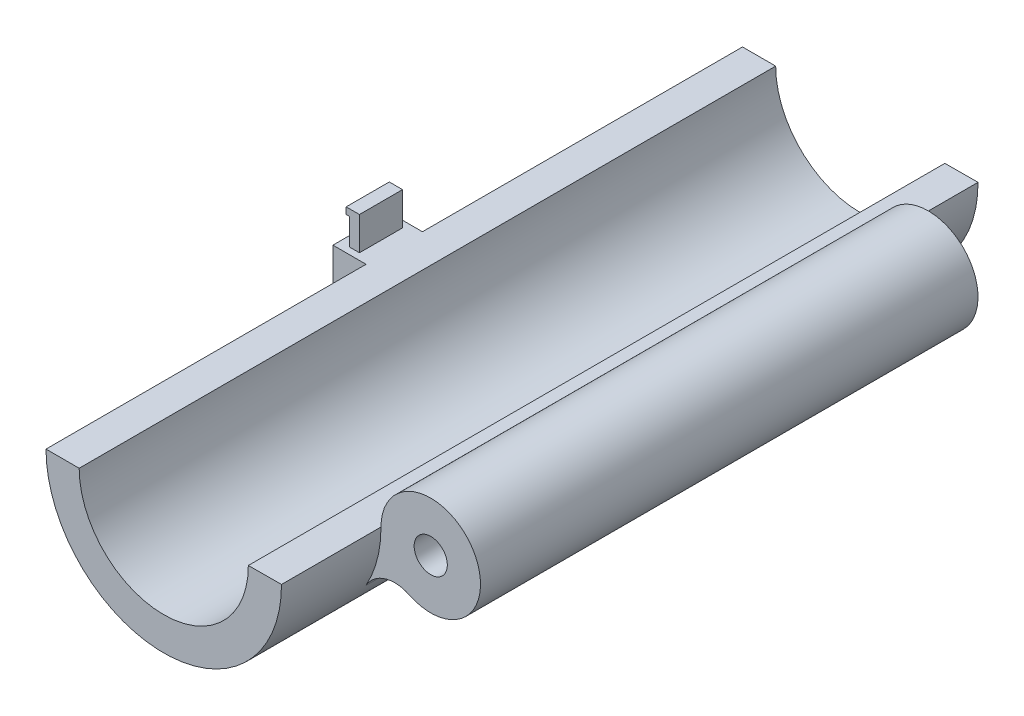
ISO-10303-21;
HEADER;
FILE_DESCRIPTION(('STEP AP214'),'2;1');
FILE_NAME('part.step','',(''),(''),'','','');
FILE_SCHEMA(('AUTOMOTIVE_DESIGN { 1 0 10303 214 1 1 1 1 }'));
ENDSEC;
DATA;
#1=APPLICATION_CONTEXT('core data for automotive mechanical design processes');
#2=APPLICATION_PROTOCOL_DEFINITION('international standard','automotive_design',2000,#1);
#3=PRODUCT_CONTEXT('',#1,'mechanical');
#4=PRODUCT('Part','Part','',(#3));
#5=PRODUCT_RELATED_PRODUCT_CATEGORY('part','',(#4));
#6=PRODUCT_DEFINITION_FORMATION('','',#4);
#7=PRODUCT_DEFINITION_CONTEXT('part definition',#1,'design');
#8=PRODUCT_DEFINITION('design','',#6,#7);
#9=PRODUCT_DEFINITION_SHAPE('','',#8);
#10=(LENGTH_UNIT() NAMED_UNIT(*) SI_UNIT(.MILLI.,.METRE.));
#11=(NAMED_UNIT(*) PLANE_ANGLE_UNIT() SI_UNIT($,.RADIAN.));
#12=(NAMED_UNIT(*) SI_UNIT($,.STERADIAN.) SOLID_ANGLE_UNIT());
#13=UNCERTAINTY_MEASURE_WITH_UNIT(LENGTH_MEASURE(1.E-05),#10,'distance_accuracy_value','');
#14=(GEOMETRIC_REPRESENTATION_CONTEXT(3) GLOBAL_UNCERTAINTY_ASSIGNED_CONTEXT((#13)) GLOBAL_UNIT_ASSIGNED_CONTEXT((#10,
#11,#12)) REPRESENTATION_CONTEXT('',''));
#15=CARTESIAN_POINT('',(0.,0.,0.));
#16=DIRECTION('',(0.,0.,1.));
#17=DIRECTION('',(1.,0.,0.));
#18=AXIS2_PLACEMENT_3D('',#15,#16,#17);
#19=CARTESIAN_POINT('',(-10.795,2.54,25.019));
#20=DIRECTION('',(1.,0.,0.));
#21=DIRECTION('',(0.,1.,0.));
#22=AXIS2_PLACEMENT_3D('',#19,#20,#21);
#23=PLANE('',#22);
#24=DIRECTION('',(0.,0.,1.));
#25=VECTOR('',#24,1.);
#26=CARTESIAN_POINT('',(-10.795,2.032,25.019));
#27=LINE('',#26,#25);
#28=CARTESIAN_POINT('',(-10.795,2.032,25.019));
#29=VERTEX_POINT('',#28);
#30=CARTESIAN_POINT('',(-10.795,2.032,28.321));
#31=VERTEX_POINT('',#30);
#32=EDGE_CURVE('E170',#29,#31,#27,.T.);
#33=ORIENTED_EDGE('',*,*,#32,.F.);
#34=DIRECTION('',(0.,-1.,0.));
#35=VECTOR('',#34,1.);
#36=CARTESIAN_POINT('',(-10.795,2.54,25.019));
#37=LINE('',#36,#35);
#38=CARTESIAN_POINT('',(-10.795,0.,25.019));
#39=VERTEX_POINT('',#38);
#40=EDGE_CURVE('E197',#29,#39,#37,.T.);
#41=ORIENTED_EDGE('',*,*,#40,.T.);
#42=DIRECTION('',(0.,0.,1.));
#43=VECTOR('',#42,1.);
#44=CARTESIAN_POINT('',(-10.795,0.,25.019));
#45=LINE('',#44,#43);
#46=CARTESIAN_POINT('',(-10.795,0.,28.321));
#47=VERTEX_POINT('',#46);
#48=EDGE_CURVE('E178',#39,#47,#45,.T.);
#49=ORIENTED_EDGE('',*,*,#48,.T.);
#50=DIRECTION('',(0.,-1.,0.));
#51=VECTOR('',#50,1.);
#52=CARTESIAN_POINT('',(-10.795,2.54,28.321));
#53=LINE('',#52,#51);
#54=EDGE_CURVE('E210',#31,#47,#53,.T.);
#55=ORIENTED_EDGE('',*,*,#54,.F.);
#56=EDGE_LOOP('',(#33,#41,#49,#55));
#57=FACE_BOUND('',#56,.T.);
#58=ADVANCED_FACE('F33',(#57),#23,.F.);
#59=CARTESIAN_POINT('',(-9.017,0.,53.34));
#60=DIRECTION('',(0.,1.,0.));
#61=DIRECTION('',(-1.,0.,0.));
#62=AXIS2_PLACEMENT_3D('',#59,#60,#61);
#63=PLANE('',#62);
#64=DIRECTION('',(0.,0.,-1.));
#65=VECTOR('',#64,1.);
#66=CARTESIAN_POINT('',(-9.017,0.,53.34));
#67=LINE('',#66,#65);
#68=CARTESIAN_POINT('',(-9.017,0.,24.511));
#69=VERTEX_POINT('',#68);
#70=CARTESIAN_POINT('',(-9.017,0.,0.));
#71=VERTEX_POINT('',#70);
#72=EDGE_CURVE('E265',#69,#71,#67,.T.);
#73=ORIENTED_EDGE('',*,*,#72,.F.);
#74=DIRECTION('',(-1.,0.,0.));
#75=VECTOR('',#74,1.);
#76=CARTESIAN_POINT('',(-11.557,0.,24.511));
#77=LINE('',#76,#75);
#78=CARTESIAN_POINT('',(-11.557,0.,24.511));
#79=VERTEX_POINT('',#78);
#80=EDGE_CURVE('E212',#69,#79,#77,.T.);
#81=ORIENTED_EDGE('',*,*,#80,.T.);
#82=DIRECTION('',(0.,0.,1.));
#83=VECTOR('',#82,1.);
#84=CARTESIAN_POINT('',(-11.557,0.,24.511));
#85=LINE('',#84,#83);
#86=CARTESIAN_POINT('',(-11.557,0.,28.829));
#87=VERTEX_POINT('',#86);
#88=EDGE_CURVE('E220',#79,#87,#85,.T.);
#89=ORIENTED_EDGE('',*,*,#88,.T.);
#90=DIRECTION('',(1.,0.,0.));
#91=VECTOR('',#90,1.);
#92=CARTESIAN_POINT('',(-11.557,0.,28.829));
#93=LINE('',#92,#91);
#94=CARTESIAN_POINT('',(-9.017,0.,28.829));
#95=VERTEX_POINT('',#94);
#96=EDGE_CURVE('E217',#87,#95,#93,.T.);
#97=ORIENTED_EDGE('',*,*,#96,.T.);
#98=CARTESIAN_POINT('',(-9.017,0.,53.34));
#99=VERTEX_POINT('',#98);
#100=EDGE_CURVE('E276',#99,#95,#67,.T.);
#101=ORIENTED_EDGE('',*,*,#100,.F.);
#102=DIRECTION('',(1.,0.,0.));
#103=VECTOR('',#102,1.);
#104=CARTESIAN_POINT('',(-9.017,0.,53.34));
#105=LINE('',#104,#103);
#106=CARTESIAN_POINT('',(-6.477,0.,53.34));
#107=VERTEX_POINT('',#106);
#108=EDGE_CURVE('E262',#99,#107,#105,.T.);
#109=ORIENTED_EDGE('',*,*,#108,.T.);
#110=DIRECTION('',(0.,0.,-1.));
#111=VECTOR('',#110,1.);
#112=CARTESIAN_POINT('',(-6.477,0.,53.34));
#113=LINE('',#112,#111);
#114=CARTESIAN_POINT('',(-6.477,0.,0.));
#115=VERTEX_POINT('',#114);
#116=EDGE_CURVE('E279',#107,#115,#113,.T.);
#117=ORIENTED_EDGE('',*,*,#116,.T.);
#118=DIRECTION('',(1.,0.,0.));
#119=VECTOR('',#118,1.);
#120=CARTESIAN_POINT('',(-9.017,0.,0.));
#121=LINE('',#120,#119);
#122=EDGE_CURVE('E256',#71,#115,#121,.T.);
#123=ORIENTED_EDGE('',*,*,#122,.F.);
#124=EDGE_LOOP('',(#73,#81,#89,#97,#101,#109,#117,#123));
#125=FACE_BOUND('',#124,.T.);
#126=DIRECTION('',(1.,0.,0.));
#127=VECTOR('',#126,1.);
#128=CARTESIAN_POINT('',(-10.795,0.,28.321));
#129=LINE('',#128,#127);
#130=CARTESIAN_POINT('',(-10.033,0.,28.321));
#131=VERTEX_POINT('',#130);
#132=EDGE_CURVE('E200',#47,#131,#129,.T.);
#133=ORIENTED_EDGE('',*,*,#132,.F.);
#134=ORIENTED_EDGE('',*,*,#48,.F.);
#135=DIRECTION('',(-1.,0.,0.));
#136=VECTOR('',#135,1.);
#137=CARTESIAN_POINT('',(-10.795,0.,25.019));
#138=LINE('',#137,#136);
#139=CARTESIAN_POINT('',(-10.033,0.,25.019));
#140=VERTEX_POINT('',#139);
#141=EDGE_CURVE('E193',#140,#39,#138,.T.);
#142=ORIENTED_EDGE('',*,*,#141,.F.);
#143=DIRECTION('',(0.,0.,-1.));
#144=VECTOR('',#143,1.);
#145=CARTESIAN_POINT('',(-10.033,0.,25.019));
#146=LINE('',#145,#144);
#147=EDGE_CURVE('E202',#131,#140,#146,.T.);
#148=ORIENTED_EDGE('',*,*,#147,.F.);
#149=EDGE_LOOP('',(#133,#134,#142,#148));
#150=FACE_BOUND('',#149,.T.);
#151=ADVANCED_FACE('F341',(#125,#150),#63,.T.);
#152=CARTESIAN_POINT('',(10.0714722573214,-5.6683062346706,53.34));
#153=DIRECTION('',(0.,0.,1.));
#154=DIRECTION('',(1.,0.,0.));
#155=AXIS2_PLACEMENT_3D('',#152,#153,#154);
#156=CYLINDRICAL_SURFACE('',#155,2.54);
#157=DIRECTION('',(0.,0.,1.));
#158=VECTOR('',#157,1.);
#159=CARTESIAN_POINT('',(11.1736399161167,-3.37989489666649,7.62));
#160=LINE('',#159,#158);
#161=CARTESIAN_POINT('',(11.1736399161167,-3.37989489666649,45.72));
#162=VERTEX_POINT('',#161);
#163=CARTESIAN_POINT('',(11.1736399161167,-3.37989489666649,7.62));
#164=VERTEX_POINT('',#163);
#165=EDGE_CURVE('E287',#162,#164,#160,.F.);
#166=ORIENTED_EDGE('',*,*,#165,.F.);
#167=CARTESIAN_POINT('',(10.0714722573214,-5.6683062346706,45.72));
#168=DIRECTION('',(0.,0.,1.));
#169=DIRECTION('',(1.,0.,0.));
#170=AXIS2_PLACEMENT_3D('',#167,#168,#169);
#171=CIRCLE('',#170,2.54);
#172=CARTESIAN_POINT('',(7.85796187109691,-4.42252464463311,45.72));
#173=VERTEX_POINT('',#172);
#174=EDGE_CURVE('E299',#162,#173,#171,.T.);
#175=ORIENTED_EDGE('',*,*,#174,.T.);
#176=DIRECTION('',(0.,0.,-1.));
#177=VECTOR('',#176,1.);
#178=CARTESIAN_POINT('',(7.85796187109691,-4.42252464463311,53.34));
#179=LINE('',#178,#177);
#180=CARTESIAN_POINT('',(7.85796187109691,-4.42252464463311,7.62));
#181=VERTEX_POINT('',#180);
#182=EDGE_CURVE('E294',#181,#173,#179,.F.);
#183=ORIENTED_EDGE('',*,*,#182,.F.);
#184=CARTESIAN_POINT('',(10.0714722573214,-5.6683062346706,7.62));
#185=DIRECTION('',(0.,0.,1.));
#186=DIRECTION('',(1.,0.,0.));
#187=AXIS2_PLACEMENT_3D('',#184,#185,#186);
#188=CIRCLE('',#187,2.54);
#189=EDGE_CURVE('E41',#181,#164,#188,.F.);
#190=ORIENTED_EDGE('',*,*,#189,.T.);
#191=EDGE_LOOP('',(#166,#175,#183,#190));
#192=FACE_BOUND('',#191,.T.);
#193=ADVANCED_FACE('F35',(#192),#156,.F.);
#194=CARTESIAN_POINT('',(0.,0.,53.34));
#195=DIRECTION('',(0.,0.,-1.));
#196=DIRECTION('',(-1.,0.,0.));
#197=AXIS2_PLACEMENT_3D('',#194,#195,#196);
#198=CYLINDRICAL_SURFACE('',#197,9.017);
#199=DIRECTION('',(0.,0.,-1.));
#200=VECTOR('',#199,1.);
#201=CARTESIAN_POINT('',(-8.65186043576756,-2.54,53.34));
#202=LINE('',#201,#200);
#203=CARTESIAN_POINT('',(-8.65186043576756,-2.54,28.829));
#204=VERTEX_POINT('',#203);
#205=CARTESIAN_POINT('',(-8.65186043576756,-2.54,24.511));
#206=VERTEX_POINT('',#205);
#207=EDGE_CURVE('E11',#204,#206,#202,.T.);
#208=ORIENTED_EDGE('',*,*,#207,.T.);
#209=CARTESIAN_POINT('',(0.,0.,24.511));
#210=DIRECTION('',(0.,0.,-1.));
#211=DIRECTION('',(-1.,0.,0.));
#212=AXIS2_PLACEMENT_3D('',#209,#210,#211);
#213=CIRCLE('',#212,9.017);
#214=EDGE_CURVE('E236',#206,#69,#213,.T.);
#215=ORIENTED_EDGE('',*,*,#214,.T.);
#216=ORIENTED_EDGE('',*,*,#72,.T.);
#217=CARTESIAN_POINT('',(0.,0.,0.));
#218=DIRECTION('',(0.,0.,1.));
#219=DIRECTION('',(1.,0.,0.));
#220=AXIS2_PLACEMENT_3D('',#217,#218,#219);
#221=CIRCLE('',#220,9.017);
#222=CARTESIAN_POINT('',(9.01691905272749,0.0382072841217275,0.));
#223=VERTEX_POINT('',#222);
#224=EDGE_CURVE('E252',#71,#223,#221,.T.);
#225=ORIENTED_EDGE('',*,*,#224,.T.);
#226=DIRECTION('',(0.,0.,-1.));
#227=VECTOR('',#226,1.);
#228=CARTESIAN_POINT('',(9.01691905272749,0.0382072841217275,53.34));
#229=LINE('',#228,#227);
#230=CARTESIAN_POINT('',(9.01691905272749,0.0382072841217275,7.62));
#231=VERTEX_POINT('',#230);
#232=EDGE_CURVE('E283',#231,#223,#229,.T.);
#233=ORIENTED_EDGE('',*,*,#232,.F.);
#234=CARTESIAN_POINT('',(12.8268914043096,0.0527221103396679,7.62));
#235=DIRECTION('',(0.,0.,1.));
#236=DIRECTION('',(1.,0.,0.));
#237=AXIS2_PLACEMENT_3D('',#234,#235,#236);
#238=CIRCLE('',#237,3.81);
#239=CARTESIAN_POINT('',(9.01692358773104,0.0370620772665923,7.62));
#240=VERTEX_POINT('',#239);
#241=EDGE_CURVE('E249',#231,#240,#238,.T.);
#242=ORIENTED_EDGE('',*,*,#241,.T.);
#243=CARTESIAN_POINT('',(0.,0.,7.62));
#244=DIRECTION('',(0.,0.,1.));
#245=DIRECTION('',(1.,0.,0.));
#246=AXIS2_PLACEMENT_3D('',#243,#244,#245);
#247=CIRCLE('',#246,9.017);
#248=EDGE_CURVE('E291',#240,#181,#247,.F.);
#249=ORIENTED_EDGE('',*,*,#248,.T.);
#250=ORIENTED_EDGE('',*,*,#182,.T.);
#251=CARTESIAN_POINT('',(0.,0.,45.72));
#252=DIRECTION('',(0.,0.,1.));
#253=DIRECTION('',(1.,0.,0.));
#254=AXIS2_PLACEMENT_3D('',#251,#252,#253);
#255=CIRCLE('',#254,9.017);
#256=CARTESIAN_POINT('',(9.01692358773104,0.0370620772665923,45.72));
#257=VERTEX_POINT('',#256);
#258=EDGE_CURVE('E297',#173,#257,#255,.T.);
#259=ORIENTED_EDGE('',*,*,#258,.T.);
#260=CARTESIAN_POINT('',(12.8268914043096,0.0527221103396679,45.72));
#261=DIRECTION('',(0.,0.,1.));
#262=DIRECTION('',(1.,0.,0.));
#263=AXIS2_PLACEMENT_3D('',#260,#261,#262);
#264=CIRCLE('',#263,3.81);
#265=CARTESIAN_POINT('',(9.01691905272749,0.0382072841217275,45.72));
#266=VERTEX_POINT('',#265);
#267=EDGE_CURVE('E242',#266,#257,#264,.T.);
#268=ORIENTED_EDGE('',*,*,#267,.F.);
#269=CARTESIAN_POINT('',(9.01691905272749,0.0382072841217275,53.34));
#270=VERTEX_POINT('',#269);
#271=EDGE_CURVE('E284',#270,#266,#229,.T.);
#272=ORIENTED_EDGE('',*,*,#271,.F.);
#273=CARTESIAN_POINT('',(0.,0.,53.34));
#274=DIRECTION('',(0.,0.,1.));
#275=DIRECTION('',(1.,0.,0.));
#276=AXIS2_PLACEMENT_3D('',#273,#274,#275);
#277=CIRCLE('',#276,9.017);
#278=EDGE_CURVE('E253',#99,#270,#277,.T.);
#279=ORIENTED_EDGE('',*,*,#278,.F.);
#280=ORIENTED_EDGE('',*,*,#100,.T.);
#281=CARTESIAN_POINT('',(0.,0.,28.829));
#282=DIRECTION('',(0.,0.,-1.));
#283=DIRECTION('',(-1.,0.,0.));
#284=AXIS2_PLACEMENT_3D('',#281,#282,#283);
#285=CIRCLE('',#284,9.017);
#286=EDGE_CURVE('E233',#204,#95,#285,.T.);
#287=ORIENTED_EDGE('',*,*,#286,.F.);
#288=EDGE_LOOP('',(#208,#215,#216,#225,#233,#242,#249,#250,#259,#268,#272,#279,#280,#287));
#289=FACE_BOUND('',#288,.T.);
#290=ADVANCED_FACE('F313',(#289),#198,.T.);
#291=CARTESIAN_POINT('',(6.47694185477609,0.0274446688761705,53.34));
#292=DIRECTION('',(-0.004237250096676,0.999991022815514,0.));
#293=DIRECTION('',(-0.999991022815514,-0.004237250096676,0.));
#294=AXIS2_PLACEMENT_3D('',#291,#292,#293);
#295=PLANE('',#294);
#296=DIRECTION('',(0.999991022815514,0.004237250096676,0.));
#297=VECTOR('',#296,1.);
#298=CARTESIAN_POINT('',(6.47694185477609,0.0274446688761705,0.));
#299=LINE('',#298,#297);
#300=CARTESIAN_POINT('',(6.47694185477609,0.0274446688761705,0.));
#301=VERTEX_POINT('',#300);
#302=EDGE_CURVE('E268',#301,#223,#299,.T.);
#303=ORIENTED_EDGE('',*,*,#302,.F.);
#304=DIRECTION('',(0.,0.,-1.));
#305=VECTOR('',#304,1.);
#306=CARTESIAN_POINT('',(6.47694185477609,0.0274446688761705,53.34));
#307=LINE('',#306,#305);
#308=CARTESIAN_POINT('',(6.47694185477609,0.0274446688761705,53.34));
#309=VERTEX_POINT('',#308);
#310=EDGE_CURVE('E281',#309,#301,#307,.T.);
#311=ORIENTED_EDGE('',*,*,#310,.F.);
#312=DIRECTION('',(0.999991022815514,0.004237250096676,0.));
#313=VECTOR('',#312,1.);
#314=CARTESIAN_POINT('',(6.47694185477609,0.0274446688761705,53.34));
#315=LINE('',#314,#313);
#316=EDGE_CURVE('E255',#309,#270,#315,.T.);
#317=ORIENTED_EDGE('',*,*,#316,.T.);
#318=ORIENTED_EDGE('',*,*,#271,.T.);
#319=EDGE_CURVE('E288',#266,#231,#229,.T.);
#320=ORIENTED_EDGE('',*,*,#319,.T.);
#321=ORIENTED_EDGE('',*,*,#232,.T.);
#322=EDGE_LOOP('',(#303,#311,#317,#318,#320,#321));
#323=FACE_BOUND('',#322,.T.);
#324=ADVANCED_FACE('F317',(#323),#295,.T.);
#325=CARTESIAN_POINT('',(0.,0.,53.34));
#326=DIRECTION('',(0.,0.,-1.));
#327=DIRECTION('',(-1.,0.,0.));
#328=AXIS2_PLACEMENT_3D('',#325,#326,#327);
#329=CYLINDRICAL_SURFACE('',#328,6.477);
#330=CARTESIAN_POINT('',(0.,0.,0.));
#331=DIRECTION('',(0.,0.,1.));
#332=DIRECTION('',(1.,0.,0.));
#333=AXIS2_PLACEMENT_3D('',#330,#331,#332);
#334=CIRCLE('',#333,6.477);
#335=EDGE_CURVE('E271',#115,#301,#334,.T.);
#336=ORIENTED_EDGE('',*,*,#335,.F.);
#337=ORIENTED_EDGE('',*,*,#116,.F.);
#338=CARTESIAN_POINT('',(0.,0.,53.34));
#339=DIRECTION('',(0.,0.,1.));
#340=DIRECTION('',(1.,0.,0.));
#341=AXIS2_PLACEMENT_3D('',#338,#339,#340);
#342=CIRCLE('',#341,6.477);
#343=EDGE_CURVE('E259',#107,#309,#342,.T.);
#344=ORIENTED_EDGE('',*,*,#343,.T.);
#345=ORIENTED_EDGE('',*,*,#310,.T.);
#346=EDGE_LOOP('',(#336,#337,#344,#345));
#347=FACE_BOUND('',#346,.T.);
#348=ADVANCED_FACE('F385',(#347),#329,.F.);
#349=CARTESIAN_POINT('',(0.,0.,53.34));
#350=DIRECTION('',(0.,0.,1.));
#351=DIRECTION('',(1.,0.,0.));
#352=AXIS2_PLACEMENT_3D('',#349,#350,#351);
#353=PLANE('',#352);
#354=ORIENTED_EDGE('',*,*,#278,.T.);
#355=ORIENTED_EDGE('',*,*,#316,.F.);
#356=ORIENTED_EDGE('',*,*,#343,.F.);
#357=ORIENTED_EDGE('',*,*,#108,.F.);
#358=EDGE_LOOP('',(#354,#355,#356,#357));
#359=FACE_BOUND('',#358,.T.);
#360=ADVANCED_FACE('F383',(#359),#353,.T.);
#361=CARTESIAN_POINT('',(0.,0.,0.));
#362=DIRECTION('',(0.,0.,1.));
#363=DIRECTION('',(1.,0.,0.));
#364=AXIS2_PLACEMENT_3D('',#361,#362,#363);
#365=PLANE('',#364);
#366=ORIENTED_EDGE('',*,*,#224,.F.);
#367=ORIENTED_EDGE('',*,*,#122,.T.);
#368=ORIENTED_EDGE('',*,*,#335,.T.);
#369=ORIENTED_EDGE('',*,*,#302,.T.);
#370=EDGE_LOOP('',(#366,#367,#368,#369));
#371=FACE_BOUND('',#370,.T.);
#372=ADVANCED_FACE('F377',(#371),#365,.F.);
#373=CARTESIAN_POINT('',(12.8268914043096,0.0527221103396679,7.62));
#374=DIRECTION('',(0.,0.,1.));
#375=DIRECTION('',(1.,0.,0.));
#376=AXIS2_PLACEMENT_3D('',#373,#374,#375);
#377=CYLINDRICAL_SURFACE('',#376,3.81);
#378=EDGE_CURVE('E241',#162,#266,#264,.T.);
#379=ORIENTED_EDGE('',*,*,#378,.F.);
#380=ORIENTED_EDGE('',*,*,#165,.T.);
#381=EDGE_CURVE('E248',#164,#231,#238,.T.);
#382=ORIENTED_EDGE('',*,*,#381,.T.);
#383=ORIENTED_EDGE('',*,*,#319,.F.);
#384=EDGE_LOOP('',(#379,#380,#382,#383));
#385=FACE_BOUND('',#384,.T.);
#386=ADVANCED_FACE('F307',(#385),#377,.T.);
#387=CARTESIAN_POINT('',(12.8268914043096,0.0527221103396679,7.62));
#388=DIRECTION('',(0.,0.,1.));
#389=DIRECTION('',(1.,0.,0.));
#390=AXIS2_PLACEMENT_3D('',#387,#388,#389);
#391=PLANE('',#390);
#392=CARTESIAN_POINT('',(12.8268914043096,0.0527221103396679,7.62));
#393=DIRECTION('',(0.,0.,1.));
#394=DIRECTION('',(1.,0.,0.));
#395=AXIS2_PLACEMENT_3D('',#392,#393,#394);
#396=CIRCLE('',#395,1.27);
#397=CARTESIAN_POINT('',(14.0968914043096,0.0527221103396679,7.62));
#398=VERTEX_POINT('',#397);
#399=EDGE_CURVE('E245',#398,#398,#396,.T.);
#400=ORIENTED_EDGE('',*,*,#399,.T.);
#401=EDGE_LOOP('',(#400));
#402=FACE_BOUND('',#401,.T.);
#403=ORIENTED_EDGE('',*,*,#241,.F.);
#404=ORIENTED_EDGE('',*,*,#381,.F.);
#405=ORIENTED_EDGE('',*,*,#189,.F.);
#406=ORIENTED_EDGE('',*,*,#248,.F.);
#407=EDGE_LOOP('',(#403,#404,#405,#406));
#408=FACE_BOUND('',#407,.T.);
#409=ADVANCED_FACE('F310',(#402,#408),#391,.F.);
#410=CARTESIAN_POINT('',(12.8268914043096,0.0527221103396679,7.62));
#411=DIRECTION('',(0.,0.,1.));
#412=DIRECTION('',(1.,0.,0.));
#413=AXIS2_PLACEMENT_3D('',#410,#411,#412);
#414=CYLINDRICAL_SURFACE('',#413,1.27);
#415=CARTESIAN_POINT('',(12.8268914043096,0.0527221103396679,45.72));
#416=DIRECTION('',(0.,0.,1.));
#417=DIRECTION('',(1.,0.,0.));
#418=AXIS2_PLACEMENT_3D('',#415,#416,#417);
#419=CIRCLE('',#418,1.27);
#420=CARTESIAN_POINT('',(14.0968914043096,0.0527221103396679,45.72));
#421=VERTEX_POINT('',#420);
#422=EDGE_CURVE('E238',#421,#421,#419,.T.);
#423=CARTESIAN_POINT('',(14.0968914043096,0.0527221103396679,7.62));
#424=CARTESIAN_POINT('',(14.0968914043096,0.0527221103396679,8.016875));
#425=CARTESIAN_POINT('',(14.0968914043096,0.0527221103396679,8.41375));
#426=CARTESIAN_POINT('',(14.0968914043096,0.0527221103396679,9.2075));
#427=CARTESIAN_POINT('',(14.0968914043096,0.0527221103396679,9.604375));
#428=CARTESIAN_POINT('',(14.0968914043096,0.0527221103396679,10.398125));
#429=CARTESIAN_POINT('',(14.0968914043096,0.0527221103396679,10.795));
#430=CARTESIAN_POINT('',(14.0968914043096,0.0527221103396679,11.58875));
#431=CARTESIAN_POINT('',(14.0968914043096,0.0527221103396679,11.985625));
#432=CARTESIAN_POINT('',(14.0968914043096,0.0527221103396679,12.779375));
#433=CARTESIAN_POINT('',(14.0968914043096,0.0527221103396679,13.17625));
#434=CARTESIAN_POINT('',(14.0968914043096,0.0527221103396679,13.97));
#435=CARTESIAN_POINT('',(14.0968914043096,0.0527221103396679,14.366875));
#436=CARTESIAN_POINT('',(14.0968914043096,0.0527221103396679,15.160625));
#437=CARTESIAN_POINT('',(14.0968914043096,0.0527221103396679,15.5575));
#438=CARTESIAN_POINT('',(14.0968914043096,0.0527221103396679,16.35125));
#439=CARTESIAN_POINT('',(14.0968914043096,0.0527221103396679,16.748125));
#440=CARTESIAN_POINT('',(14.0968914043096,0.0527221103396679,17.541875));
#441=CARTESIAN_POINT('',(14.0968914043096,0.0527221103396679,17.93875));
#442=CARTESIAN_POINT('',(14.0968914043096,0.0527221103396679,18.7325));
#443=CARTESIAN_POINT('',(14.0968914043096,0.0527221103396679,19.129375));
#444=CARTESIAN_POINT('',(14.0968914043096,0.0527221103396679,19.923125));
#445=CARTESIAN_POINT('',(14.0968914043096,0.0527221103396679,20.32));
#446=CARTESIAN_POINT('',(14.0968914043096,0.0527221103396679,21.11375));
#447=CARTESIAN_POINT('',(14.0968914043096,0.0527221103396679,21.510625));
#448=CARTESIAN_POINT('',(14.0968914043096,0.0527221103396679,22.304375));
#449=CARTESIAN_POINT('',(14.0968914043096,0.0527221103396679,22.70125));
#450=CARTESIAN_POINT('',(14.0968914043096,0.0527221103396679,23.495));
#451=CARTESIAN_POINT('',(14.0968914043096,0.0527221103396679,23.891875));
#452=CARTESIAN_POINT('',(14.0968914043096,0.0527221103396679,24.685625));
#453=CARTESIAN_POINT('',(14.0968914043096,0.0527221103396679,25.0825));
#454=CARTESIAN_POINT('',(14.0968914043096,0.0527221103396679,25.87625));
#455=CARTESIAN_POINT('',(14.0968914043096,0.0527221103396679,26.273125));
#456=CARTESIAN_POINT('',(14.0968914043096,0.0527221103396679,27.066875));
#457=CARTESIAN_POINT('',(14.0968914043096,0.0527221103396679,27.46375));
#458=CARTESIAN_POINT('',(14.0968914043096,0.0527221103396679,28.2575));
#459=CARTESIAN_POINT('',(14.0968914043096,0.0527221103396679,28.654375));
#460=CARTESIAN_POINT('',(14.0968914043096,0.0527221103396679,29.448125));
#461=CARTESIAN_POINT('',(14.0968914043096,0.0527221103396679,29.845));
#462=CARTESIAN_POINT('',(14.0968914043096,0.0527221103396679,30.63875));
#463=CARTESIAN_POINT('',(14.0968914043096,0.0527221103396679,31.035625));
#464=CARTESIAN_POINT('',(14.0968914043096,0.0527221103396679,31.829375));
#465=CARTESIAN_POINT('',(14.0968914043096,0.0527221103396679,32.22625));
#466=CARTESIAN_POINT('',(14.0968914043096,0.0527221103396679,33.02));
#467=CARTESIAN_POINT('',(14.0968914043096,0.0527221103396679,33.416875));
#468=CARTESIAN_POINT('',(14.0968914043096,0.0527221103396679,34.210625));
#469=CARTESIAN_POINT('',(14.0968914043096,0.0527221103396679,34.6075));
#470=CARTESIAN_POINT('',(14.0968914043096,0.0527221103396679,35.40125));
#471=CARTESIAN_POINT('',(14.0968914043096,0.0527221103396679,35.798125));
#472=CARTESIAN_POINT('',(14.0968914043096,0.0527221103396679,36.591875));
#473=CARTESIAN_POINT('',(14.0968914043096,0.0527221103396679,36.98875));
#474=CARTESIAN_POINT('',(14.0968914043096,0.0527221103396679,37.7825));
#475=CARTESIAN_POINT('',(14.0968914043096,0.0527221103396679,38.179375));
#476=CARTESIAN_POINT('',(14.0968914043096,0.0527221103396679,38.973125));
#477=CARTESIAN_POINT('',(14.0968914043096,0.0527221103396679,39.37));
#478=CARTESIAN_POINT('',(14.0968914043096,0.0527221103396679,40.16375));
#479=CARTESIAN_POINT('',(14.0968914043096,0.0527221103396679,40.560625));
#480=CARTESIAN_POINT('',(14.0968914043096,0.0527221103396679,41.354375));
#481=CARTESIAN_POINT('',(14.0968914043096,0.0527221103396679,41.75125));
#482=CARTESIAN_POINT('',(14.0968914043096,0.0527221103396679,42.545));
#483=CARTESIAN_POINT('',(14.0968914043096,0.0527221103396679,42.941875));
#484=CARTESIAN_POINT('',(14.0968914043096,0.0527221103396679,43.735625));
#485=CARTESIAN_POINT('',(14.0968914043096,0.0527221103396679,44.1325));
#486=CARTESIAN_POINT('',(14.0968914043096,0.0527221103396679,44.92625));
#487=CARTESIAN_POINT('',(14.0968914043096,0.0527221103396679,45.323125));
#488=CARTESIAN_POINT('',(14.0968914043096,0.0527221103396679,45.72));
#489=B_SPLINE_CURVE_WITH_KNOTS('',3,(#423,#424,#425,#426,#427,#428,#429,#430,#431,#432,#433,
#434,#435,#436,#437,#438,#439,#440,#441,#442,#443,#444,#445,#446,#447,#448,#449,#450,#451,#452,
#453,#454,#455,#456,#457,#458,#459,#460,#461,#462,#463,#464,#465,#466,#467,#468,#469,#470,#471,
#472,#473,#474,#475,#476,#477,#478,#479,#480,#481,#482,#483,#484,#485,#486,#487,#488),
.UNSPECIFIED.,.F.,.F.,(4,2,2,2,2,2,2,2,2,2,2,2,2,2,2,2,2,2,2,2,2,2,2,2,2,2,2,2,2,2,2,2,4),(0.,
1.190625,2.38125,3.571875,4.7625,5.953125,7.14375,8.33437499999999,9.525,10.715625,11.90625,
13.096875,14.2875,15.478125,16.66875,17.859375,19.05,20.240625,21.43125,22.621875,23.8125,
25.003125,26.19375,27.384375,28.575,29.765625,30.95625,32.146875,33.3375,34.528125,35.71875,
36.909375,38.1),.UNSPECIFIED.);
#490=EDGE_CURVE('BSEAM327',#398,#421,#489,.T.);
#491=ORIENTED_EDGE('',*,*,#399,.F.);
#492=ORIENTED_EDGE('',*,*,#422,.T.);
#493=ORIENTED_EDGE('',*,*,#490,.T.);
#494=ORIENTED_EDGE('',*,*,#490,.F.);
#495=EDGE_LOOP('',(#491,#493,#492,#494));
#496=FACE_BOUND('',#495,.T.);
#497=ADVANCED_FACE('F327',(#496),#414,.F.);
#498=CARTESIAN_POINT('',(12.8268914043096,0.0527221103396679,45.72));
#499=DIRECTION('',(0.,0.,1.));
#500=DIRECTION('',(1.,0.,0.));
#501=AXIS2_PLACEMENT_3D('',#498,#499,#500);
#502=PLANE('',#501);
#503=ORIENTED_EDGE('',*,*,#267,.T.);
#504=ORIENTED_EDGE('',*,*,#258,.F.);
#505=ORIENTED_EDGE('',*,*,#174,.F.);
#506=ORIENTED_EDGE('',*,*,#378,.T.);
#507=EDGE_LOOP('',(#503,#504,#505,#506));
#508=FACE_BOUND('',#507,.T.);
#509=ORIENTED_EDGE('',*,*,#422,.F.);
#510=EDGE_LOOP('',(#509));
#511=FACE_BOUND('',#510,.T.);
#512=ADVANCED_FACE('F323',(#508,#511),#502,.T.);
#513=CARTESIAN_POINT('',(0.,-2.54,0.));
#514=DIRECTION('',(0.,-1.,0.));
#515=DIRECTION('',(-1.,0.,0.));
#516=AXIS2_PLACEMENT_3D('',#513,#514,#515);
#517=PLANE('',#516);
#518=ORIENTED_EDGE('',*,*,#207,.F.);
#519=DIRECTION('',(1.,0.,0.));
#520=VECTOR('',#519,1.);
#521=CARTESIAN_POINT('',(-9.017,-2.54,28.829));
#522=LINE('',#521,#520);
#523=CARTESIAN_POINT('',(-11.557,-2.54,28.829));
#524=VERTEX_POINT('',#523);
#525=EDGE_CURVE('E230',#524,#204,#522,.T.);
#526=ORIENTED_EDGE('',*,*,#525,.F.);
#527=DIRECTION('',(0.,0.,1.));
#528=VECTOR('',#527,1.);
#529=CARTESIAN_POINT('',(-11.557,-2.54,24.511));
#530=LINE('',#529,#528);
#531=CARTESIAN_POINT('',(-11.557,-2.54,24.511));
#532=VERTEX_POINT('',#531);
#533=EDGE_CURVE('E213',#532,#524,#530,.T.);
#534=ORIENTED_EDGE('',*,*,#533,.F.);
#535=DIRECTION('',(-1.,0.,0.));
#536=VECTOR('',#535,1.);
#537=CARTESIAN_POINT('',(-9.017,-2.54,24.511));
#538=LINE('',#537,#536);
#539=EDGE_CURVE('E226',#532,#206,#538,.F.);
#540=ORIENTED_EDGE('',*,*,#539,.T.);
#541=EDGE_LOOP('',(#518,#526,#534,#540));
#542=FACE_BOUND('',#541,.T.);
#543=ADVANCED_FACE('F326',(#542),#517,.T.);
#544=CARTESIAN_POINT('',(-9.017,0.,24.511));
#545=DIRECTION('',(0.,0.,-1.));
#546=DIRECTION('',(-1.,0.,0.));
#547=AXIS2_PLACEMENT_3D('',#544,#545,#546);
#548=PLANE('',#547);
#549=ORIENTED_EDGE('',*,*,#214,.F.);
#550=ORIENTED_EDGE('',*,*,#539,.F.);
#551=DIRECTION('',(0.,1.,0.));
#552=VECTOR('',#551,1.);
#553=CARTESIAN_POINT('',(-11.557,-2.54,24.511));
#554=LINE('',#553,#552);
#555=EDGE_CURVE('E216',#532,#79,#554,.T.);
#556=ORIENTED_EDGE('',*,*,#555,.T.);
#557=ORIENTED_EDGE('',*,*,#80,.F.);
#558=EDGE_LOOP('',(#549,#550,#556,#557));
#559=FACE_BOUND('',#558,.T.);
#560=ADVANCED_FACE('F359',(#559),#548,.T.);
#561=CARTESIAN_POINT('',(-9.017,0.,28.829));
#562=DIRECTION('',(0.,0.,-1.));
#563=DIRECTION('',(-1.,0.,0.));
#564=AXIS2_PLACEMENT_3D('',#561,#562,#563);
#565=PLANE('',#564);
#566=ORIENTED_EDGE('',*,*,#525,.T.);
#567=ORIENTED_EDGE('',*,*,#286,.T.);
#568=ORIENTED_EDGE('',*,*,#96,.F.);
#569=DIRECTION('',(0.,1.,0.));
#570=VECTOR('',#569,1.);
#571=CARTESIAN_POINT('',(-11.557,-2.54,28.829));
#572=LINE('',#571,#570);
#573=EDGE_CURVE('E224',#524,#87,#572,.T.);
#574=ORIENTED_EDGE('',*,*,#573,.F.);
#575=EDGE_LOOP('',(#566,#567,#568,#574));
#576=FACE_BOUND('',#575,.T.);
#577=ADVANCED_FACE('F355',(#576),#565,.F.);
#578=CARTESIAN_POINT('',(-11.557,-2.54,24.511));
#579=DIRECTION('',(-1.,0.,0.));
#580=DIRECTION('',(0.,0.,1.));
#581=AXIS2_PLACEMENT_3D('',#578,#579,#580);
#582=PLANE('',#581);
#583=ORIENTED_EDGE('',*,*,#88,.F.);
#584=ORIENTED_EDGE('',*,*,#555,.F.);
#585=ORIENTED_EDGE('',*,*,#533,.T.);
#586=ORIENTED_EDGE('',*,*,#573,.T.);
#587=EDGE_LOOP('',(#583,#584,#585,#586));
#588=FACE_BOUND('',#587,.T.);
#589=ADVANCED_FACE('F352',(#588),#582,.T.);
#590=CARTESIAN_POINT('',(-10.795,2.54,28.321));
#591=DIRECTION('',(0.,0.,-1.));
#592=DIRECTION('',(-1.,0.,0.));
#593=AXIS2_PLACEMENT_3D('',#590,#591,#592);
#594=PLANE('',#593);
#595=ORIENTED_EDGE('',*,*,#132,.T.);
#596=DIRECTION('',(0.,-1.,0.));
#597=VECTOR('',#596,1.);
#598=CARTESIAN_POINT('',(-10.033,2.54,28.321));
#599=LINE('',#598,#597);
#600=CARTESIAN_POINT('',(-10.033,2.54,28.321));
#601=VERTEX_POINT('',#600);
#602=EDGE_CURVE('E207',#601,#131,#599,.T.);
#603=ORIENTED_EDGE('',*,*,#602,.F.);
#604=DIRECTION('',(1.,0.,0.));
#605=VECTOR('',#604,1.);
#606=CARTESIAN_POINT('',(-10.795,2.54,28.321));
#607=LINE('',#606,#605);
#608=CARTESIAN_POINT('',(-11.049,2.54,28.321));
#609=VERTEX_POINT('',#608);
#610=EDGE_CURVE('E183',#609,#601,#607,.T.);
#611=ORIENTED_EDGE('',*,*,#610,.F.);
#612=DIRECTION('',(0.,-1.,0.));
#613=VECTOR('',#612,1.);
#614=CARTESIAN_POINT('',(-11.049,2.54,28.321));
#615=LINE('',#614,#613);
#616=CARTESIAN_POINT('',(-11.049,2.032,28.321));
#617=VERTEX_POINT('',#616);
#618=EDGE_CURVE('E165',#609,#617,#615,.T.);
#619=ORIENTED_EDGE('',*,*,#618,.T.);
#620=DIRECTION('',(1.,0.,0.));
#621=VECTOR('',#620,1.);
#622=CARTESIAN_POINT('',(-11.049,2.032,28.321));
#623=LINE('',#622,#621);
#624=EDGE_CURVE('E173',#617,#31,#623,.T.);
#625=ORIENTED_EDGE('',*,*,#624,.T.);
#626=ORIENTED_EDGE('',*,*,#54,.T.);
#627=EDGE_LOOP('',(#595,#603,#611,#619,#625,#626));
#628=FACE_BOUND('',#627,.T.);
#629=ADVANCED_FACE('F181',(#628),#594,.F.);
#630=CARTESIAN_POINT('',(-10.033,2.54,25.019));
#631=DIRECTION('',(-1.,0.,0.));
#632=DIRECTION('',(0.,-1.,0.));
#633=AXIS2_PLACEMENT_3D('',#630,#631,#632);
#634=PLANE('',#633);
#635=ORIENTED_EDGE('',*,*,#147,.T.);
#636=DIRECTION('',(0.,-1.,0.));
#637=VECTOR('',#636,1.);
#638=CARTESIAN_POINT('',(-10.033,2.54,25.019));
#639=LINE('',#638,#637);
#640=CARTESIAN_POINT('',(-10.033,2.54,25.019));
#641=VERTEX_POINT('',#640);
#642=EDGE_CURVE('E48',#641,#140,#639,.T.);
#643=ORIENTED_EDGE('',*,*,#642,.F.);
#644=DIRECTION('',(0.,0.,-1.));
#645=VECTOR('',#644,1.);
#646=CARTESIAN_POINT('',(-10.033,2.54,25.019));
#647=LINE('',#646,#645);
#648=EDGE_CURVE('E192',#601,#641,#647,.T.);
#649=ORIENTED_EDGE('',*,*,#648,.F.);
#650=ORIENTED_EDGE('',*,*,#602,.T.);
#651=EDGE_LOOP('',(#635,#643,#649,#650));
#652=FACE_BOUND('',#651,.T.);
#653=ADVANCED_FACE('F477',(#652),#634,.F.);
#654=CARTESIAN_POINT('',(-10.795,2.54,25.019));
#655=DIRECTION('',(0.,0.,1.));
#656=DIRECTION('',(1.,0.,0.));
#657=AXIS2_PLACEMENT_3D('',#654,#655,#656);
#658=PLANE('',#657);
#659=ORIENTED_EDGE('',*,*,#141,.T.);
#660=ORIENTED_EDGE('',*,*,#40,.F.);
#661=DIRECTION('',(1.,0.,0.));
#662=VECTOR('',#661,1.);
#663=CARTESIAN_POINT('',(-11.049,2.032,25.019));
#664=LINE('',#663,#662);
#665=CARTESIAN_POINT('',(-11.049,2.032,25.019));
#666=VERTEX_POINT('',#665);
#667=EDGE_CURVE('E179',#666,#29,#664,.T.);
#668=ORIENTED_EDGE('',*,*,#667,.F.);
#669=DIRECTION('',(0.,1.,0.));
#670=VECTOR('',#669,1.);
#671=CARTESIAN_POINT('',(-11.049,2.032,25.019));
#672=LINE('',#671,#670);
#673=CARTESIAN_POINT('',(-11.049,2.54,25.019));
#674=VERTEX_POINT('',#673);
#675=EDGE_CURVE('E168',#666,#674,#672,.T.);
#676=ORIENTED_EDGE('',*,*,#675,.T.);
#677=DIRECTION('',(-1.,0.,0.));
#678=VECTOR('',#677,1.);
#679=CARTESIAN_POINT('',(-10.795,2.54,25.019));
#680=LINE('',#679,#678);
#681=EDGE_CURVE('E195',#641,#674,#680,.T.);
#682=ORIENTED_EDGE('',*,*,#681,.F.);
#683=ORIENTED_EDGE('',*,*,#642,.T.);
#684=EDGE_LOOP('',(#659,#660,#668,#676,#682,#683));
#685=FACE_BOUND('',#684,.T.);
#686=ADVANCED_FACE('F487',(#685),#658,.F.);
#687=CARTESIAN_POINT('',(0.,2.54,0.));
#688=DIRECTION('',(0.,1.,0.));
#689=DIRECTION('',(-1.,0.,0.));
#690=AXIS2_PLACEMENT_3D('',#687,#688,#689);
#691=PLANE('',#690);
#692=ORIENTED_EDGE('',*,*,#681,.T.);
#693=DIRECTION('',(0.,0.,1.));
#694=VECTOR('',#693,1.);
#695=CARTESIAN_POINT('',(-11.049,2.54,25.019));
#696=LINE('',#695,#694);
#697=EDGE_CURVE('E184',#674,#609,#696,.T.);
#698=ORIENTED_EDGE('',*,*,#697,.T.);
#699=ORIENTED_EDGE('',*,*,#610,.T.);
#700=ORIENTED_EDGE('',*,*,#648,.T.);
#701=EDGE_LOOP('',(#692,#698,#699,#700));
#702=FACE_BOUND('',#701,.T.);
#703=ADVANCED_FACE('F494',(#702),#691,.T.);
#704=CARTESIAN_POINT('',(-11.049,2.032,25.019));
#705=DIRECTION('',(0.,1.,0.));
#706=DIRECTION('',(-1.,0.,0.));
#707=AXIS2_PLACEMENT_3D('',#704,#705,#706);
#708=PLANE('',#707);
#709=ORIENTED_EDGE('',*,*,#32,.T.);
#710=ORIENTED_EDGE('',*,*,#624,.F.);
#711=DIRECTION('',(0.,0.,1.));
#712=VECTOR('',#711,1.);
#713=CARTESIAN_POINT('',(-11.049,2.032,25.019));
#714=LINE('',#713,#712);
#715=EDGE_CURVE('E160',#666,#617,#714,.T.);
#716=ORIENTED_EDGE('',*,*,#715,.F.);
#717=ORIENTED_EDGE('',*,*,#667,.T.);
#718=EDGE_LOOP('',(#709,#710,#716,#717));
#719=FACE_BOUND('',#718,.T.);
#720=ADVANCED_FACE('F174',(#719),#708,.F.);
#721=CARTESIAN_POINT('',(-11.049,0.,0.));
#722=DIRECTION('',(1.,0.,0.));
#723=DIRECTION('',(0.,0.,-1.));
#724=AXIS2_PLACEMENT_3D('',#721,#722,#723);
#725=PLANE('',#724);
#726=ORIENTED_EDGE('',*,*,#715,.T.);
#727=ORIENTED_EDGE('',*,*,#618,.F.);
#728=ORIENTED_EDGE('',*,*,#697,.F.);
#729=ORIENTED_EDGE('',*,*,#675,.F.);
#730=EDGE_LOOP('',(#726,#727,#728,#729));
#731=FACE_BOUND('',#730,.T.);
#732=ADVANCED_FACE('F162',(#731),#725,.F.);
#733=CLOSED_SHELL('',(#58,#151,#193,#290,#324,#348,#360,#372,#386,#409,#497,#512,#543,#560,#577,
#589,#629,#653,#686,#703,#720,#732));
#734=MANIFOLD_SOLID_BREP('B2',#733);
#735=ADVANCED_BREP_SHAPE_REPRESENTATION('',(#18,#734),#14);
#736=SHAPE_DEFINITION_REPRESENTATION(#9,#735);
ENDSEC;
END-ISO-10303-21;
